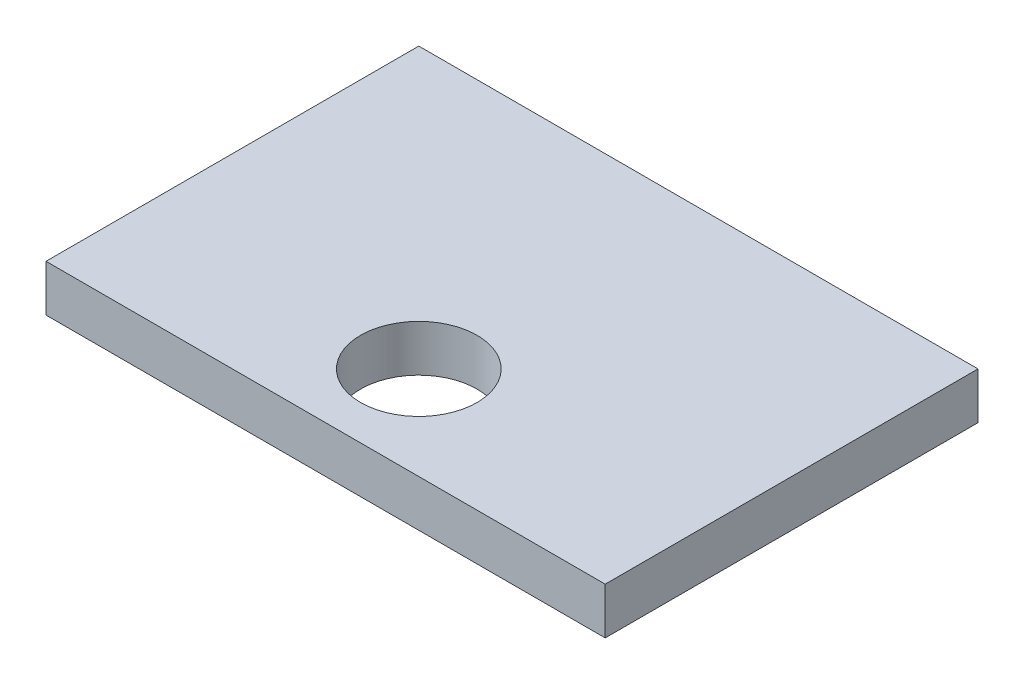
ISO-10303-21;
HEADER;
FILE_DESCRIPTION(('STEP AP214'),'2;1');
FILE_NAME('part.step','',(''),(''),'','','');
FILE_SCHEMA(('AUTOMOTIVE_DESIGN { 1 0 10303 214 1 1 1 1 }'));
ENDSEC;
DATA;
#1=APPLICATION_CONTEXT('core data for automotive mechanical design processes');
#2=APPLICATION_PROTOCOL_DEFINITION('international standard','automotive_design',2000,#1);
#3=PRODUCT_CONTEXT('',#1,'mechanical');
#4=PRODUCT('Part','Part','',(#3));
#5=PRODUCT_RELATED_PRODUCT_CATEGORY('part','',(#4));
#6=PRODUCT_DEFINITION_FORMATION('','',#4);
#7=PRODUCT_DEFINITION_CONTEXT('part definition',#1,'design');
#8=PRODUCT_DEFINITION('design','',#6,#7);
#9=PRODUCT_DEFINITION_SHAPE('','',#8);
#10=(LENGTH_UNIT() NAMED_UNIT(*) SI_UNIT(.MILLI.,.METRE.));
#11=(NAMED_UNIT(*) PLANE_ANGLE_UNIT() SI_UNIT($,.RADIAN.));
#12=(NAMED_UNIT(*) SI_UNIT($,.STERADIAN.) SOLID_ANGLE_UNIT());
#13=UNCERTAINTY_MEASURE_WITH_UNIT(LENGTH_MEASURE(1.E-05),#10,'distance_accuracy_value','');
#14=(GEOMETRIC_REPRESENTATION_CONTEXT(3) GLOBAL_UNCERTAINTY_ASSIGNED_CONTEXT((#13)) GLOBAL_UNIT_ASSIGNED_CONTEXT((#10,
#11,#12)) REPRESENTATION_CONTEXT('',''));
#15=CARTESIAN_POINT('',(0.,0.,0.));
#16=DIRECTION('',(0.,0.,1.));
#17=DIRECTION('',(1.,0.,0.));
#18=AXIS2_PLACEMENT_3D('',#15,#16,#17);
#19=CARTESIAN_POINT('',(0.,10.,0.));
#20=DIRECTION('',(1.,0.,0.));
#21=DIRECTION('',(0.,0.,-1.));
#22=AXIS2_PLACEMENT_3D('',#19,#20,#21);
#23=PLANE('',#22);
#24=DIRECTION('',(0.,0.,1.));
#25=VECTOR('',#24,1.);
#26=CARTESIAN_POINT('',(0.,0.,0.));
#27=LINE('',#26,#25);
#28=CARTESIAN_POINT('',(0.,0.,-80.));
#29=VERTEX_POINT('',#28);
#30=CARTESIAN_POINT('',(0.,0.,0.));
#31=VERTEX_POINT('',#30);
#32=EDGE_CURVE('E100',#29,#31,#27,.T.);
#33=ORIENTED_EDGE('',*,*,#32,.T.);
#34=DIRECTION('',(0.,-1.,0.));
#35=VECTOR('',#34,1.);
#36=CARTESIAN_POINT('',(0.,10.,0.));
#37=LINE('',#36,#35);
#38=CARTESIAN_POINT('',(0.,10.,0.));
#39=VERTEX_POINT('',#38);
#40=EDGE_CURVE('E11',#39,#31,#37,.T.);
#41=ORIENTED_EDGE('',*,*,#40,.F.);
#42=DIRECTION('',(0.,0.,1.));
#43=VECTOR('',#42,1.);
#44=CARTESIAN_POINT('',(0.,10.,0.));
#45=LINE('',#44,#43);
#46=CARTESIAN_POINT('',(0.,10.,-80.));
#47=VERTEX_POINT('',#46);
#48=EDGE_CURVE('E88',#47,#39,#45,.T.);
#49=ORIENTED_EDGE('',*,*,#48,.F.);
#50=DIRECTION('',(0.,-1.,0.));
#51=VECTOR('',#50,1.);
#52=CARTESIAN_POINT('',(0.,10.,-80.));
#53=LINE('',#52,#51);
#54=EDGE_CURVE('E96',#47,#29,#53,.T.);
#55=ORIENTED_EDGE('',*,*,#54,.T.);
#56=EDGE_LOOP('',(#33,#41,#49,#55));
#57=FACE_BOUND('',#56,.T.);
#58=ADVANCED_FACE('F37',(#57),#23,.F.);
#59=CARTESIAN_POINT('',(0.,10.,0.));
#60=DIRECTION('',(0.,0.,-1.));
#61=DIRECTION('',(-1.,0.,0.));
#62=AXIS2_PLACEMENT_3D('',#59,#60,#61);
#63=PLANE('',#62);
#64=DIRECTION('',(1.,0.,0.));
#65=VECTOR('',#64,1.);
#66=CARTESIAN_POINT('',(0.,0.,0.));
#67=LINE('',#66,#65);
#68=CARTESIAN_POINT('',(120.,0.,0.));
#69=VERTEX_POINT('',#68);
#70=EDGE_CURVE('E92',#31,#69,#67,.T.);
#71=ORIENTED_EDGE('',*,*,#70,.T.);
#72=DIRECTION('',(0.,-1.,0.));
#73=VECTOR('',#72,1.);
#74=CARTESIAN_POINT('',(120.,10.,0.));
#75=LINE('',#74,#73);
#76=CARTESIAN_POINT('',(120.,10.,0.));
#77=VERTEX_POINT('',#76);
#78=EDGE_CURVE('E45',#77,#69,#75,.T.);
#79=ORIENTED_EDGE('',*,*,#78,.F.);
#80=DIRECTION('',(1.,0.,0.));
#81=VECTOR('',#80,1.);
#82=CARTESIAN_POINT('',(0.,10.,0.));
#83=LINE('',#82,#81);
#84=EDGE_CURVE('E83',#39,#77,#83,.T.);
#85=ORIENTED_EDGE('',*,*,#84,.F.);
#86=ORIENTED_EDGE('',*,*,#40,.T.);
#87=EDGE_LOOP('',(#71,#79,#85,#86));
#88=FACE_BOUND('',#87,.T.);
#89=ADVANCED_FACE('F91',(#88),#63,.F.);
#90=CARTESIAN_POINT('',(120.,10.,0.));
#91=DIRECTION('',(-1.,0.,0.));
#92=DIRECTION('',(0.,0.,1.));
#93=AXIS2_PLACEMENT_3D('',#90,#91,#92);
#94=PLANE('',#93);
#95=DIRECTION('',(0.,0.,-1.));
#96=VECTOR('',#95,1.);
#97=CARTESIAN_POINT('',(120.,0.,0.));
#98=LINE('',#97,#96);
#99=CARTESIAN_POINT('',(120.,0.,-80.));
#100=VERTEX_POINT('',#99);
#101=EDGE_CURVE('E70',#69,#100,#98,.T.);
#102=ORIENTED_EDGE('',*,*,#101,.T.);
#103=DIRECTION('',(0.,-1.,0.));
#104=VECTOR('',#103,1.);
#105=CARTESIAN_POINT('',(120.,10.,-80.));
#106=LINE('',#105,#104);
#107=CARTESIAN_POINT('',(120.,10.,-80.));
#108=VERTEX_POINT('',#107);
#109=EDGE_CURVE('E93',#108,#100,#106,.T.);
#110=ORIENTED_EDGE('',*,*,#109,.F.);
#111=DIRECTION('',(0.,0.,-1.));
#112=VECTOR('',#111,1.);
#113=CARTESIAN_POINT('',(120.,10.,0.));
#114=LINE('',#113,#112);
#115=EDGE_CURVE('E86',#77,#108,#114,.T.);
#116=ORIENTED_EDGE('',*,*,#115,.F.);
#117=ORIENTED_EDGE('',*,*,#78,.T.);
#118=EDGE_LOOP('',(#102,#110,#116,#117));
#119=FACE_BOUND('',#118,.T.);
#120=ADVANCED_FACE('F94',(#119),#94,.F.);
#121=CARTESIAN_POINT('',(0.,10.,-80.));
#122=DIRECTION('',(0.,0.,1.));
#123=DIRECTION('',(1.,0.,0.));
#124=AXIS2_PLACEMENT_3D('',#121,#122,#123);
#125=PLANE('',#124);
#126=DIRECTION('',(-1.,0.,0.));
#127=VECTOR('',#126,1.);
#128=CARTESIAN_POINT('',(0.,0.,-80.));
#129=LINE('',#128,#127);
#130=EDGE_CURVE('E76',#100,#29,#129,.T.);
#131=ORIENTED_EDGE('',*,*,#130,.T.);
#132=ORIENTED_EDGE('',*,*,#54,.F.);
#133=DIRECTION('',(-1.,0.,0.));
#134=VECTOR('',#133,1.);
#135=CARTESIAN_POINT('',(0.,10.,-80.));
#136=LINE('',#135,#134);
#137=EDGE_CURVE('E53',#108,#47,#136,.T.);
#138=ORIENTED_EDGE('',*,*,#137,.F.);
#139=ORIENTED_EDGE('',*,*,#109,.T.);
#140=EDGE_LOOP('',(#131,#132,#138,#139));
#141=FACE_BOUND('',#140,.T.);
#142=ADVANCED_FACE('F108',(#141),#125,.F.);
#143=CARTESIAN_POINT('',(0.,10.,0.));
#144=DIRECTION('',(0.,-1.,0.));
#145=DIRECTION('',(0.,0.,-1.));
#146=AXIS2_PLACEMENT_3D('',#143,#144,#145);
#147=PLANE('',#146);
#148=CARTESIAN_POINT('',(60.,10.,-20.));
#149=DIRECTION('',(0.,1.,0.));
#150=DIRECTION('',(0.,0.,1.));
#151=AXIS2_PLACEMENT_3D('',#148,#149,#150);
#152=CIRCLE('',#151,12.5);
#153=CARTESIAN_POINT('',(60.,10.,-7.5));
#154=VERTEX_POINT('',#153);
#155=EDGE_CURVE('E114',#154,#154,#152,.T.);
#156=ORIENTED_EDGE('',*,*,#155,.F.);
#157=EDGE_LOOP('',(#156));
#158=FACE_BOUND('',#157,.T.);
#159=ORIENTED_EDGE('',*,*,#48,.T.);
#160=ORIENTED_EDGE('',*,*,#84,.T.);
#161=ORIENTED_EDGE('',*,*,#115,.T.);
#162=ORIENTED_EDGE('',*,*,#137,.T.);
#163=EDGE_LOOP('',(#159,#160,#161,#162));
#164=FACE_BOUND('',#163,.T.);
#165=ADVANCED_FACE('F84',(#158,#164),#147,.F.);
#166=CARTESIAN_POINT('',(0.,0.,0.));
#167=DIRECTION('',(0.,-1.,0.));
#168=DIRECTION('',(0.,0.,-1.));
#169=AXIS2_PLACEMENT_3D('',#166,#167,#168);
#170=PLANE('',#169);
#171=CARTESIAN_POINT('',(60.,0.,-20.));
#172=DIRECTION('',(0.,1.,0.));
#173=DIRECTION('',(0.,0.,1.));
#174=AXIS2_PLACEMENT_3D('',#171,#172,#173);
#175=CIRCLE('',#174,12.5);
#176=CARTESIAN_POINT('',(60.,0.,-7.5));
#177=VERTEX_POINT('',#176);
#178=EDGE_CURVE('E103',#177,#177,#175,.T.);
#179=ORIENTED_EDGE('',*,*,#178,.T.);
#180=EDGE_LOOP('',(#179));
#181=FACE_BOUND('',#180,.T.);
#182=ORIENTED_EDGE('',*,*,#32,.F.);
#183=ORIENTED_EDGE('',*,*,#130,.F.);
#184=ORIENTED_EDGE('',*,*,#101,.F.);
#185=ORIENTED_EDGE('',*,*,#70,.F.);
#186=EDGE_LOOP('',(#182,#183,#184,#185));
#187=FACE_BOUND('',#186,.T.);
#188=ADVANCED_FACE('F111',(#181,#187),#170,.T.);
#189=CARTESIAN_POINT('',(60.,0.,-20.));
#190=DIRECTION('',(0.,1.,0.));
#191=DIRECTION('',(0.,0.,1.));
#192=AXIS2_PLACEMENT_3D('',#189,#190,#191);
#193=CYLINDRICAL_SURFACE('',#192,12.5);
#194=ORIENTED_EDGE('',*,*,#178,.F.);
#195=EDGE_LOOP('',(#194));
#196=FACE_BOUND('',#195,.T.);
#197=ORIENTED_EDGE('',*,*,#155,.T.);
#198=EDGE_LOOP('',(#197));
#199=FACE_BOUND('',#198,.T.);
#200=ADVANCED_FACE('F121',(#196,#199),#193,.F.);
#201=CLOSED_SHELL('',(#58,#89,#120,#142,#165,#188,#200));
#202=MANIFOLD_SOLID_BREP('B2',#201);
#203=ADVANCED_BREP_SHAPE_REPRESENTATION('',(#18,#202),#14);
#204=SHAPE_DEFINITION_REPRESENTATION(#9,#203);
ENDSEC;
END-ISO-10303-21;
